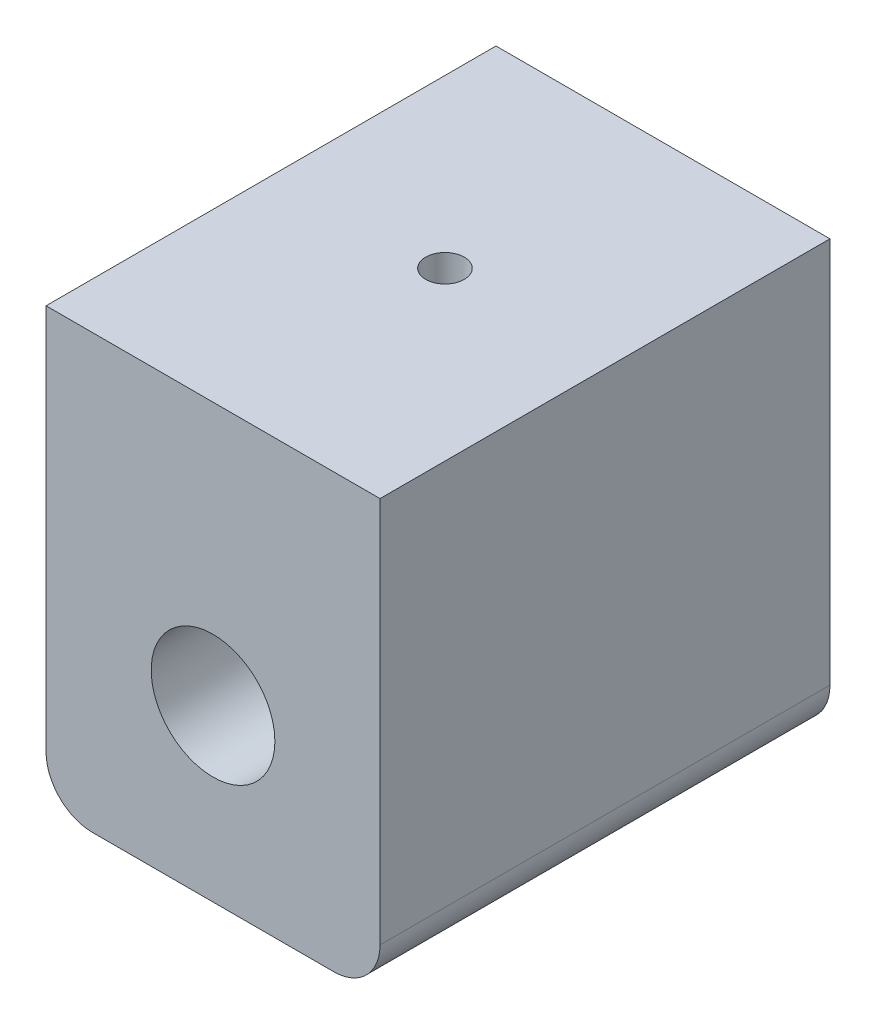
ISO-10303-21;
HEADER;
FILE_DESCRIPTION(('STEP AP214'),'2;1');
FILE_NAME('part.step','',(''),(''),'','','');
FILE_SCHEMA(('AUTOMOTIVE_DESIGN { 1 0 10303 214 1 1 1 1 }'));
ENDSEC;
DATA;
#1=APPLICATION_CONTEXT('core data for automotive mechanical design processes');
#2=APPLICATION_PROTOCOL_DEFINITION('international standard','automotive_design',2000,#1);
#3=PRODUCT_CONTEXT('',#1,'mechanical');
#4=PRODUCT('Part','Part','',(#3));
#5=PRODUCT_RELATED_PRODUCT_CATEGORY('part','',(#4));
#6=PRODUCT_DEFINITION_FORMATION('','',#4);
#7=PRODUCT_DEFINITION_CONTEXT('part definition',#1,'design');
#8=PRODUCT_DEFINITION('design','',#6,#7);
#9=PRODUCT_DEFINITION_SHAPE('','',#8);
#10=(LENGTH_UNIT() NAMED_UNIT(*) SI_UNIT(.MILLI.,.METRE.));
#11=(NAMED_UNIT(*) PLANE_ANGLE_UNIT() SI_UNIT($,.RADIAN.));
#12=(NAMED_UNIT(*) SI_UNIT($,.STERADIAN.) SOLID_ANGLE_UNIT());
#13=UNCERTAINTY_MEASURE_WITH_UNIT(LENGTH_MEASURE(1.E-05),#10,'distance_accuracy_value','');
#14=(GEOMETRIC_REPRESENTATION_CONTEXT(3) GLOBAL_UNCERTAINTY_ASSIGNED_CONTEXT((#13)) GLOBAL_UNIT_ASSIGNED_CONTEXT((#10,
#11,#12)) REPRESENTATION_CONTEXT('',''));
#15=CARTESIAN_POINT('',(0.,0.,0.));
#16=DIRECTION('',(0.,0.,1.));
#17=DIRECTION('',(1.,0.,0.));
#18=AXIS2_PLACEMENT_3D('',#15,#16,#17);
#19=CARTESIAN_POINT('',(-5.86105340387706,10.9504195270786,82.7));
#20=DIRECTION('',(0.,-1.,0.));
#21=DIRECTION('',(0.,0.,-1.));
#22=AXIS2_PLACEMENT_3D('',#19,#20,#21);
#23=PLANE('',#22);
#24=CARTESIAN_POINT('',(-5.86105340387706,10.9504195270786,82.7));
#25=DIRECTION('',(0.,-1.,0.));
#26=DIRECTION('',(0.,0.,-1.));
#27=AXIS2_PLACEMENT_3D('',#24,#25,#26);
#28=CIRCLE('',#27,1.25);
#29=CARTESIAN_POINT('',(-5.86105340387706,10.9504195270786,81.45));
#30=VERTEX_POINT('',#29);
#31=EDGE_CURVE('E21',#30,#30,#28,.F.);
#32=ORIENTED_EDGE('',*,*,#31,.T.);
#33=EDGE_LOOP('',(#32));
#34=FACE_BOUND('',#33,.T.);
#35=ADVANCED_FACE('F18',(#34),#23,.F.);
#36=CARTESIAN_POINT('',(-5.86105340387706,17.9504195270786,82.7));
#37=DIRECTION('',(0.,-1.,0.));
#38=DIRECTION('',(0.,0.,-1.));
#39=AXIS2_PLACEMENT_3D('',#36,#37,#38);
#40=CYLINDRICAL_SURFACE('',#39,1.25);
#41=CARTESIAN_POINT('',(-5.86105340387706,17.9504195270786,82.7));
#42=DIRECTION('',(0.,-1.,0.));
#43=DIRECTION('',(0.,0.,-1.));
#44=AXIS2_PLACEMENT_3D('',#41,#42,#43);
#45=CIRCLE('',#44,1.25);
#46=CARTESIAN_POINT('',(-5.86105340387706,17.9504195270786,81.45));
#47=VERTEX_POINT('',#46);
#48=EDGE_CURVE('E121',#47,#47,#45,.T.);
#49=ORIENTED_EDGE('',*,*,#48,.F.);
#50=EDGE_LOOP('',(#49));
#51=FACE_BOUND('',#50,.T.);
#52=ORIENTED_EDGE('',*,*,#31,.F.);
#53=EDGE_LOOP('',(#52));
#54=FACE_BOUND('',#53,.T.);
#55=ADVANCED_FACE('F156',(#51,#54),#40,.F.);
#56=CARTESIAN_POINT('',(4.93894659612294,-10.0495804729214,97.7));
#57=DIRECTION('',(1.,0.,0.));
#58=DIRECTION('',(0.,0.,-1.));
#59=AXIS2_PLACEMENT_3D('',#56,#57,#58);
#60=PLANE('',#59);
#61=DIRECTION('',(0.,1.,0.));
#62=VECTOR('',#61,1.);
#63=CARTESIAN_POINT('',(4.93894659612294,-0.169434475005503,97.7));
#64=LINE('',#63,#62);
#65=CARTESIAN_POINT('',(4.93894659612294,-7.04958047292143,97.7));
#66=VERTEX_POINT('',#65);
#67=CARTESIAN_POINT('',(4.93894659612294,17.9504195270786,97.7));
#68=VERTEX_POINT('',#67);
#69=EDGE_CURVE('E72',#66,#68,#64,.T.);
#70=ORIENTED_EDGE('',*,*,#69,.F.);
#71=DIRECTION('',(0.,0.,1.));
#72=VECTOR('',#71,1.);
#73=CARTESIAN_POINT('',(4.93894659612294,-7.04958047292143,97.7));
#74=LINE('',#73,#72);
#75=CARTESIAN_POINT('',(4.93894659612294,-7.04958047292143,68.6));
#76=VERTEX_POINT('',#75);
#77=EDGE_CURVE('E65',#76,#66,#74,.T.);
#78=ORIENTED_EDGE('',*,*,#77,.F.);
#79=DIRECTION('',(0.,1.,0.));
#80=VECTOR('',#79,1.);
#81=CARTESIAN_POINT('',(4.93894659612294,-0.169434475005503,68.6));
#82=LINE('',#81,#80);
#83=CARTESIAN_POINT('',(4.93894659612294,17.9504195270786,68.6));
#84=VERTEX_POINT('',#83);
#85=EDGE_CURVE('E133',#76,#84,#82,.T.);
#86=ORIENTED_EDGE('',*,*,#85,.T.);
#87=DIRECTION('',(0.,0.,1.));
#88=VECTOR('',#87,1.);
#89=CARTESIAN_POINT('',(4.93894659612294,17.9504195270786,97.7));
#90=LINE('',#89,#88);
#91=EDGE_CURVE('E90',#68,#84,#90,.F.);
#92=ORIENTED_EDGE('',*,*,#91,.F.);
#93=EDGE_LOOP('',(#70,#78,#86,#92));
#94=FACE_BOUND('',#93,.T.);
#95=ADVANCED_FACE('F154',(#94),#60,.T.);
#96=CARTESIAN_POINT('',(1.93894659612294,-7.04958047292143,97.7));
#97=DIRECTION('',(0.,0.,1.));
#98=DIRECTION('',(1.,0.,0.));
#99=AXIS2_PLACEMENT_3D('',#96,#97,#98);
#100=CYLINDRICAL_SURFACE('',#99,3.);
#101=CARTESIAN_POINT('',(1.93894659612294,-7.04958047292143,97.7));
#102=DIRECTION('',(0.,0.,1.));
#103=DIRECTION('',(1.,0.,0.));
#104=AXIS2_PLACEMENT_3D('',#101,#102,#103);
#105=CIRCLE('',#104,3.);
#106=CARTESIAN_POINT('',(1.93894659612294,-10.0495804729214,97.7));
#107=VERTEX_POINT('',#106);
#108=EDGE_CURVE('E112',#107,#66,#105,.T.);
#109=ORIENTED_EDGE('',*,*,#108,.F.);
#110=DIRECTION('',(0.,0.,-1.));
#111=VECTOR('',#110,1.);
#112=CARTESIAN_POINT('',(1.93894659612294,-10.0495804729214,97.7));
#113=LINE('',#112,#111);
#114=CARTESIAN_POINT('',(1.93894659612294,-10.0495804729214,68.6));
#115=VERTEX_POINT('',#114);
#116=EDGE_CURVE('E60',#115,#107,#113,.F.);
#117=ORIENTED_EDGE('',*,*,#116,.F.);
#118=CARTESIAN_POINT('',(1.93894659612294,-7.04958047292143,68.6));
#119=DIRECTION('',(0.,0.,1.));
#120=DIRECTION('',(1.,0.,0.));
#121=AXIS2_PLACEMENT_3D('',#118,#119,#120);
#122=CIRCLE('',#121,3.);
#123=EDGE_CURVE('E128',#115,#76,#122,.T.);
#124=ORIENTED_EDGE('',*,*,#123,.T.);
#125=ORIENTED_EDGE('',*,*,#77,.T.);
#126=EDGE_LOOP('',(#109,#117,#124,#125));
#127=FACE_BOUND('',#126,.T.);
#128=ADVANCED_FACE('F135',(#127),#100,.T.);
#129=CARTESIAN_POINT('',(-5.86105340387706,0.950419527078566,97.7));
#130=DIRECTION('',(0.,0.,1.));
#131=DIRECTION('',(1.,0.,0.));
#132=AXIS2_PLACEMENT_3D('',#129,#130,#131);
#133=CYLINDRICAL_SURFACE('',#132,4.);
#134=CARTESIAN_POINT('',(-5.86105340387706,0.950419527078566,68.6));
#135=DIRECTION('',(0.,0.,1.));
#136=DIRECTION('',(1.,0.,0.));
#137=AXIS2_PLACEMENT_3D('',#134,#135,#136);
#138=CIRCLE('',#137,4.);
#139=CARTESIAN_POINT('',(-1.86105340387705,0.950419527078566,68.6));
#140=VERTEX_POINT('',#139);
#141=EDGE_CURVE('E125',#140,#140,#138,.F.);
#142=ORIENTED_EDGE('',*,*,#141,.T.);
#143=EDGE_LOOP('',(#142));
#144=FACE_BOUND('',#143,.T.);
#145=CARTESIAN_POINT('',(-5.86105340387706,0.950419527078566,97.7));
#146=DIRECTION('',(0.,0.,1.));
#147=DIRECTION('',(1.,0.,0.));
#148=AXIS2_PLACEMENT_3D('',#145,#146,#147);
#149=CIRCLE('',#148,4.);
#150=CARTESIAN_POINT('',(-1.86105340387705,0.950419527078566,97.7));
#151=VERTEX_POINT('',#150);
#152=EDGE_CURVE('E91',#151,#151,#149,.F.);
#153=ORIENTED_EDGE('',*,*,#152,.F.);
#154=EDGE_LOOP('',(#153));
#155=FACE_BOUND('',#154,.T.);
#156=ADVANCED_FACE('F163',(#144,#155),#133,.F.);
#157=CARTESIAN_POINT('',(-16.6610534038771,-10.0495804729214,97.7));
#158=DIRECTION('',(0.,-1.,0.));
#159=DIRECTION('',(0.,0.,-1.));
#160=AXIS2_PLACEMENT_3D('',#157,#158,#159);
#161=PLANE('',#160);
#162=DIRECTION('',(1.,0.,0.));
#163=VECTOR('',#162,1.);
#164=CARTESIAN_POINT('',(-3.73953728865364,-10.0495804729214,68.6));
#165=LINE('',#164,#163);
#166=CARTESIAN_POINT('',(-13.6610534038771,-10.0495804729214,68.6));
#167=VERTEX_POINT('',#166);
#168=EDGE_CURVE('E130',#167,#115,#165,.T.);
#169=ORIENTED_EDGE('',*,*,#168,.T.);
#170=ORIENTED_EDGE('',*,*,#116,.T.);
#171=DIRECTION('',(1.,0.,0.));
#172=VECTOR('',#171,1.);
#173=CARTESIAN_POINT('',(-3.73953728865364,-10.0495804729214,97.7));
#174=LINE('',#173,#172);
#175=CARTESIAN_POINT('',(-13.6610534038771,-10.0495804729214,97.7));
#176=VERTEX_POINT('',#175);
#177=EDGE_CURVE('E78',#176,#107,#174,.T.);
#178=ORIENTED_EDGE('',*,*,#177,.F.);
#179=DIRECTION('',(0.,0.,1.));
#180=VECTOR('',#179,1.);
#181=CARTESIAN_POINT('',(-13.6610534038771,-10.0495804729214,97.7));
#182=LINE('',#181,#180);
#183=EDGE_CURVE('E104',#167,#176,#182,.T.);
#184=ORIENTED_EDGE('',*,*,#183,.F.);
#185=EDGE_LOOP('',(#169,#170,#178,#184));
#186=FACE_BOUND('',#185,.T.);
#187=ADVANCED_FACE('F138',(#186),#161,.T.);
#188=CARTESIAN_POINT('',(-3.73953728865364,-0.169434475005503,97.7));
#189=DIRECTION('',(0.,0.,1.));
#190=DIRECTION('',(1.,0.,0.));
#191=AXIS2_PLACEMENT_3D('',#188,#189,#190);
#192=PLANE('',#191);
#193=ORIENTED_EDGE('',*,*,#152,.T.);
#194=EDGE_LOOP('',(#193));
#195=FACE_BOUND('',#194,.T.);
#196=ORIENTED_EDGE('',*,*,#69,.T.);
#197=DIRECTION('',(1.,0.,0.));
#198=VECTOR('',#197,1.);
#199=CARTESIAN_POINT('',(4.93894659612294,17.9504195270786,97.7));
#200=LINE('',#199,#198);
#201=CARTESIAN_POINT('',(-16.6610534038771,17.9504195270786,97.7));
#202=VERTEX_POINT('',#201);
#203=EDGE_CURVE('E85',#202,#68,#200,.T.);
#204=ORIENTED_EDGE('',*,*,#203,.F.);
#205=DIRECTION('',(0.,1.,0.));
#206=VECTOR('',#205,1.);
#207=CARTESIAN_POINT('',(-16.6610534038771,17.9504195270786,97.7));
#208=LINE('',#207,#206);
#209=CARTESIAN_POINT('',(-16.6610534038771,-7.04958047292143,97.7));
#210=VERTEX_POINT('',#209);
#211=EDGE_CURVE('E82',#210,#202,#208,.T.);
#212=ORIENTED_EDGE('',*,*,#211,.F.);
#213=CARTESIAN_POINT('',(-13.6610534038771,-7.04958047292143,97.7));
#214=DIRECTION('',(0.,0.,1.));
#215=DIRECTION('',(1.,0.,0.));
#216=AXIS2_PLACEMENT_3D('',#213,#214,#215);
#217=CIRCLE('',#216,3.);
#218=EDGE_CURVE('E102',#176,#210,#217,.F.);
#219=ORIENTED_EDGE('',*,*,#218,.F.);
#220=ORIENTED_EDGE('',*,*,#177,.T.);
#221=ORIENTED_EDGE('',*,*,#108,.T.);
#222=EDGE_LOOP('',(#196,#204,#212,#219,#220,#221));
#223=FACE_BOUND('',#222,.T.);
#224=ADVANCED_FACE('F87',(#195,#223),#192,.T.);
#225=CARTESIAN_POINT('',(4.93894659612294,17.9504195270786,97.7));
#226=DIRECTION('',(0.,1.,0.));
#227=DIRECTION('',(0.,0.,1.));
#228=AXIS2_PLACEMENT_3D('',#225,#226,#227);
#229=PLANE('',#228);
#230=ORIENTED_EDGE('',*,*,#48,.T.);
#231=EDGE_LOOP('',(#230));
#232=FACE_BOUND('',#231,.T.);
#233=DIRECTION('',(1.,0.,0.));
#234=VECTOR('',#233,1.);
#235=CARTESIAN_POINT('',(-3.73953728865364,17.9504195270786,68.6));
#236=LINE('',#235,#234);
#237=CARTESIAN_POINT('',(-16.6610534038771,17.9504195270786,68.6));
#238=VERTEX_POINT('',#237);
#239=EDGE_CURVE('E97',#84,#238,#236,.F.);
#240=ORIENTED_EDGE('',*,*,#239,.T.);
#241=DIRECTION('',(0.,0.,1.));
#242=VECTOR('',#241,1.);
#243=CARTESIAN_POINT('',(-16.6610534038771,17.9504195270786,97.7));
#244=LINE('',#243,#242);
#245=EDGE_CURVE('E94',#202,#238,#244,.F.);
#246=ORIENTED_EDGE('',*,*,#245,.F.);
#247=ORIENTED_EDGE('',*,*,#203,.T.);
#248=ORIENTED_EDGE('',*,*,#91,.T.);
#249=EDGE_LOOP('',(#240,#246,#247,#248));
#250=FACE_BOUND('',#249,.T.);
#251=ADVANCED_FACE('F95',(#232,#250),#229,.T.);
#252=CARTESIAN_POINT('',(-3.73953728865364,-0.169434475005503,68.6));
#253=DIRECTION('',(0.,0.,1.));
#254=DIRECTION('',(1.,0.,0.));
#255=AXIS2_PLACEMENT_3D('',#252,#253,#254);
#256=PLANE('',#255);
#257=ORIENTED_EDGE('',*,*,#141,.F.);
#258=EDGE_LOOP('',(#257));
#259=FACE_BOUND('',#258,.T.);
#260=ORIENTED_EDGE('',*,*,#168,.F.);
#261=CARTESIAN_POINT('',(-13.6610534038771,-7.04958047292143,68.6));
#262=DIRECTION('',(0.,0.,1.));
#263=DIRECTION('',(1.,0.,0.));
#264=AXIS2_PLACEMENT_3D('',#261,#262,#263);
#265=CIRCLE('',#264,3.);
#266=CARTESIAN_POINT('',(-16.6610534038771,-7.04958047292143,68.6));
#267=VERTEX_POINT('',#266);
#268=EDGE_CURVE('E36',#267,#167,#265,.T.);
#269=ORIENTED_EDGE('',*,*,#268,.F.);
#270=DIRECTION('',(0.,1.,0.));
#271=VECTOR('',#270,1.);
#272=CARTESIAN_POINT('',(-16.6610534038771,17.9504195270786,68.6));
#273=LINE('',#272,#271);
#274=EDGE_CURVE('E27',#238,#267,#273,.F.);
#275=ORIENTED_EDGE('',*,*,#274,.F.);
#276=ORIENTED_EDGE('',*,*,#239,.F.);
#277=ORIENTED_EDGE('',*,*,#85,.F.);
#278=ORIENTED_EDGE('',*,*,#123,.F.);
#279=EDGE_LOOP('',(#260,#269,#275,#276,#277,#278));
#280=FACE_BOUND('',#279,.T.);
#281=ADVANCED_FACE('F140',(#259,#280),#256,.F.);
#282=CARTESIAN_POINT('',(-13.6610534038771,-7.04958047292143,97.7));
#283=DIRECTION('',(0.,0.,1.));
#284=DIRECTION('',(1.,0.,0.));
#285=AXIS2_PLACEMENT_3D('',#282,#283,#284);
#286=CYLINDRICAL_SURFACE('',#285,3.);
#287=ORIENTED_EDGE('',*,*,#218,.T.);
#288=DIRECTION('',(0.,0.,1.));
#289=VECTOR('',#288,1.);
#290=CARTESIAN_POINT('',(-16.6610534038771,-7.04958047292143,97.7));
#291=LINE('',#290,#289);
#292=EDGE_CURVE('E11',#267,#210,#291,.T.);
#293=ORIENTED_EDGE('',*,*,#292,.F.);
#294=ORIENTED_EDGE('',*,*,#268,.T.);
#295=ORIENTED_EDGE('',*,*,#183,.T.);
#296=EDGE_LOOP('',(#287,#293,#294,#295));
#297=FACE_BOUND('',#296,.T.);
#298=ADVANCED_FACE('F167',(#297),#286,.T.);
#299=CARTESIAN_POINT('',(-16.6610534038771,17.9504195270786,97.7));
#300=DIRECTION('',(-1.,0.,0.));
#301=DIRECTION('',(0.,0.,1.));
#302=AXIS2_PLACEMENT_3D('',#299,#300,#301);
#303=PLANE('',#302);
#304=ORIENTED_EDGE('',*,*,#274,.T.);
#305=ORIENTED_EDGE('',*,*,#292,.T.);
#306=ORIENTED_EDGE('',*,*,#211,.T.);
#307=ORIENTED_EDGE('',*,*,#245,.T.);
#308=EDGE_LOOP('',(#304,#305,#306,#307));
#309=FACE_BOUND('',#308,.T.);
#310=ADVANCED_FACE('F101',(#309),#303,.T.);
#311=CLOSED_SHELL('',(#35,#55,#95,#128,#156,#187,#224,#251,#281,#298,#310));
#312=MANIFOLD_SOLID_BREP('B1',#311);
#313=ADVANCED_BREP_SHAPE_REPRESENTATION('',(#18,#312),#14);
#314=SHAPE_DEFINITION_REPRESENTATION(#9,#313);
ENDSEC;
END-ISO-10303-21;
